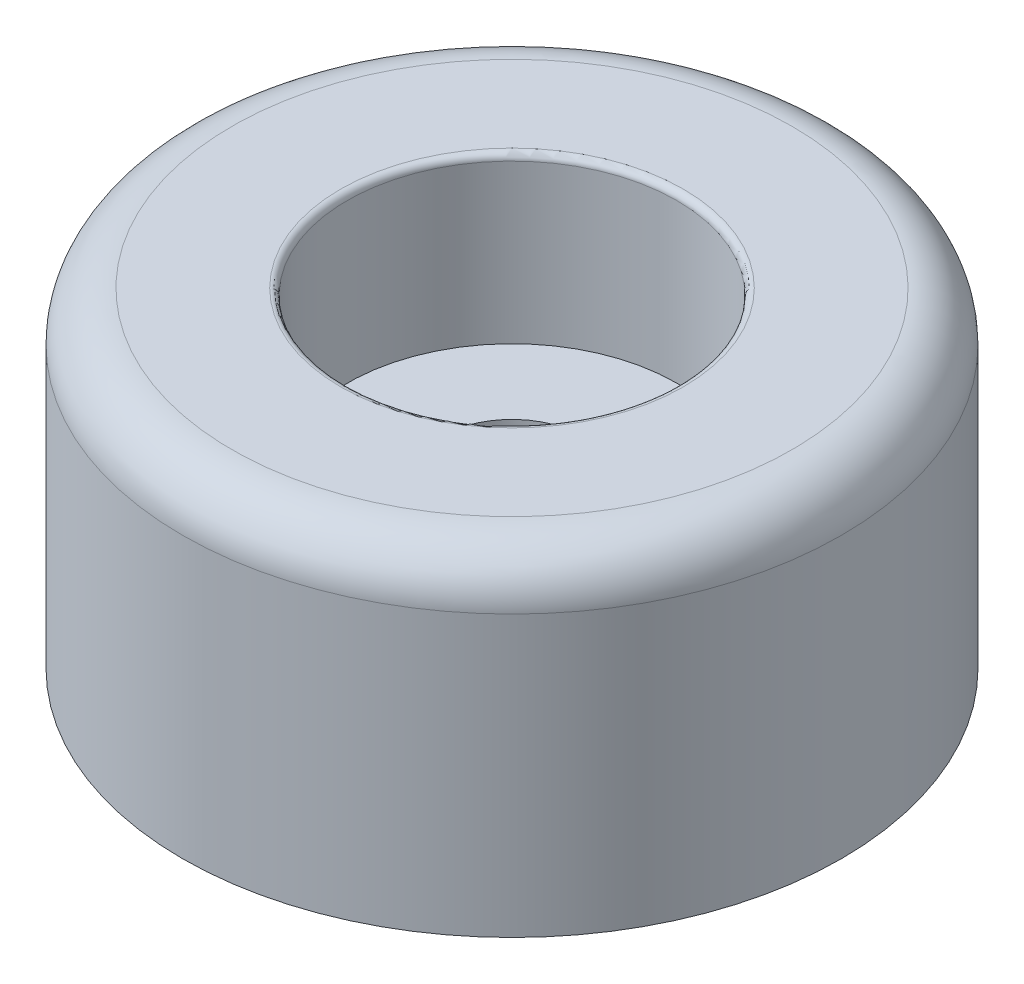
ISO-10303-21;
HEADER;
FILE_DESCRIPTION(('STEP AP214'),'2;1');
FILE_NAME('part.step','',(''),(''),'','','');
FILE_SCHEMA(('AUTOMOTIVE_DESIGN { 1 0 10303 214 1 1 1 1 }'));
ENDSEC;
DATA;
#1=APPLICATION_CONTEXT('core data for automotive mechanical design processes');
#2=APPLICATION_PROTOCOL_DEFINITION('international standard','automotive_design',2000,#1);
#3=PRODUCT_CONTEXT('',#1,'mechanical');
#4=PRODUCT('Part','Part','',(#3));
#5=PRODUCT_RELATED_PRODUCT_CATEGORY('part','',(#4));
#6=PRODUCT_DEFINITION_FORMATION('','',#4);
#7=PRODUCT_DEFINITION_CONTEXT('part definition',#1,'design');
#8=PRODUCT_DEFINITION('design','',#6,#7);
#9=PRODUCT_DEFINITION_SHAPE('','',#8);
#10=(LENGTH_UNIT() NAMED_UNIT(*) SI_UNIT(.MILLI.,.METRE.));
#11=(NAMED_UNIT(*) PLANE_ANGLE_UNIT() SI_UNIT($,.RADIAN.));
#12=(NAMED_UNIT(*) SI_UNIT($,.STERADIAN.) SOLID_ANGLE_UNIT());
#13=UNCERTAINTY_MEASURE_WITH_UNIT(LENGTH_MEASURE(1.E-05),#10,'distance_accuracy_value','');
#14=(GEOMETRIC_REPRESENTATION_CONTEXT(3) GLOBAL_UNCERTAINTY_ASSIGNED_CONTEXT((#13)) GLOBAL_UNIT_ASSIGNED_CONTEXT((#10,
#11,#12)) REPRESENTATION_CONTEXT('',''));
#15=CARTESIAN_POINT('',(0.,0.,0.));
#16=DIRECTION('',(0.,0.,1.));
#17=DIRECTION('',(1.,0.,0.));
#18=AXIS2_PLACEMENT_3D('',#15,#16,#17);
#19=CARTESIAN_POINT('',(-2.778125,0.,0.));
#20=DIRECTION('',(0.,1.,0.));
#21=DIRECTION('',(0.,0.,1.));
#22=AXIS2_PLACEMENT_3D('',#19,#20,#21);
#23=PLANE('',#22);
#24=CARTESIAN_POINT('',(0.,0.,0.));
#25=DIRECTION('',(0.,-1.,0.));
#26=DIRECTION('',(0.,0.,-1.));
#27=AXIS2_PLACEMENT_3D('',#24,#25,#26);
#28=CIRCLE('',#27,2.778125);
#29=CARTESIAN_POINT('',(0.,0.,-2.778125));
#30=VERTEX_POINT('',#29);
#31=EDGE_CURVE('E44',#30,#30,#28,.T.);
#32=ORIENTED_EDGE('',*,*,#31,.F.);
#33=EDGE_LOOP('',(#32));
#34=FACE_BOUND('',#33,.T.);
#35=CARTESIAN_POINT('',(0.,0.,0.));
#36=DIRECTION('',(0.,-1.,0.));
#37=DIRECTION('',(0.,0.,-1.));
#38=AXIS2_PLACEMENT_3D('',#35,#36,#37);
#39=CIRCLE('',#38,12.7);
#40=CARTESIAN_POINT('',(0.,0.,-12.7));
#41=VERTEX_POINT('',#40);
#42=EDGE_CURVE('E62',#41,#41,#39,.T.);
#43=ORIENTED_EDGE('',*,*,#42,.T.);
#44=EDGE_LOOP('',(#43));
#45=FACE_BOUND('',#44,.T.);
#46=ADVANCED_FACE('F33',(#34,#45),#23,.F.);
#47=CARTESIAN_POINT('',(0.,0.,0.));
#48=DIRECTION('',(0.,-1.,0.));
#49=DIRECTION('',(0.,0.,-1.));
#50=AXIS2_PLACEMENT_3D('',#47,#48,#49);
#51=CYLINDRICAL_SURFACE('',#50,2.778125);
#52=CARTESIAN_POINT('',(0.,6.34999999999999,0.));
#53=DIRECTION('',(0.,-1.,0.));
#54=DIRECTION('',(0.,0.,-1.));
#55=AXIS2_PLACEMENT_3D('',#52,#53,#54);
#56=CIRCLE('',#55,2.778125);
#57=CARTESIAN_POINT('',(0.,6.34999999999999,-2.778125));
#58=VERTEX_POINT('',#57);
#59=EDGE_CURVE('E48',#58,#58,#56,.T.);
#60=ORIENTED_EDGE('',*,*,#59,.F.);
#61=EDGE_LOOP('',(#60));
#62=FACE_BOUND('',#61,.T.);
#63=ORIENTED_EDGE('',*,*,#31,.T.);
#64=EDGE_LOOP('',(#63));
#65=FACE_BOUND('',#64,.T.);
#66=ADVANCED_FACE('F89',(#62,#65),#51,.F.);
#67=CARTESIAN_POINT('',(-6.35,6.34999999999999,0.));
#68=DIRECTION('',(0.,-1.,0.));
#69=DIRECTION('',(0.,0.,-1.));
#70=AXIS2_PLACEMENT_3D('',#67,#68,#69);
#71=PLANE('',#70);
#72=CARTESIAN_POINT('',(0.,6.34999999999999,0.));
#73=DIRECTION('',(0.,-1.,0.));
#74=DIRECTION('',(0.,0.,-1.));
#75=AXIS2_PLACEMENT_3D('',#72,#73,#74);
#76=CIRCLE('',#75,6.35);
#77=CARTESIAN_POINT('',(0.,6.34999999999999,-6.35));
#78=VERTEX_POINT('',#77);
#79=EDGE_CURVE('E53',#78,#78,#76,.T.);
#80=ORIENTED_EDGE('',*,*,#79,.F.);
#81=EDGE_LOOP('',(#80));
#82=FACE_BOUND('',#81,.T.);
#83=ORIENTED_EDGE('',*,*,#59,.T.);
#84=EDGE_LOOP('',(#83));
#85=FACE_BOUND('',#84,.T.);
#86=ADVANCED_FACE('F86',(#82,#85),#71,.F.);
#87=CARTESIAN_POINT('',(0.,0.,0.));
#88=DIRECTION('',(0.,-1.,0.));
#89=DIRECTION('',(0.,0.,-1.));
#90=AXIS2_PLACEMENT_3D('',#87,#88,#89);
#91=CYLINDRICAL_SURFACE('',#90,6.35);
#92=CARTESIAN_POINT('',(0.,12.446,0.));
#93=DIRECTION('',(0.,-1.,0.));
#94=DIRECTION('',(0.,0.,-1.));
#95=AXIS2_PLACEMENT_3D('',#92,#93,#94);
#96=CIRCLE('',#95,6.35);
#97=CARTESIAN_POINT('',(0.,12.446,-6.35));
#98=VERTEX_POINT('',#97);
#99=EDGE_CURVE('E10',#98,#98,#96,.F.);
#100=ORIENTED_EDGE('',*,*,#99,.T.);
#101=EDGE_LOOP('',(#100));
#102=FACE_BOUND('',#101,.T.);
#103=ORIENTED_EDGE('',*,*,#79,.T.);
#104=EDGE_LOOP('',(#103));
#105=FACE_BOUND('',#104,.T.);
#106=ADVANCED_FACE('F81',(#102,#105),#91,.F.);
#107=CARTESIAN_POINT('',(-10.795,12.7,0.));
#108=DIRECTION('',(0.,-1.,0.));
#109=DIRECTION('',(0.,0.,-1.));
#110=AXIS2_PLACEMENT_3D('',#107,#108,#109);
#111=PLANE('',#110);
#112=CARTESIAN_POINT('',(0.,12.7,0.));
#113=DIRECTION('',(0.,-1.,0.));
#114=DIRECTION('',(0.,0.,-1.));
#115=AXIS2_PLACEMENT_3D('',#112,#113,#114);
#116=CIRCLE('',#115,6.604);
#117=CARTESIAN_POINT('',(0.,12.7,-6.604));
#118=VERTEX_POINT('',#117);
#119=EDGE_CURVE('E40',#118,#118,#116,.T.);
#120=ORIENTED_EDGE('',*,*,#119,.T.);
#121=EDGE_LOOP('',(#120));
#122=FACE_BOUND('',#121,.T.);
#123=CARTESIAN_POINT('',(0.,12.7,0.));
#124=DIRECTION('',(0.,-1.,0.));
#125=DIRECTION('',(0.,0.,-1.));
#126=AXIS2_PLACEMENT_3D('',#123,#124,#125);
#127=CIRCLE('',#126,10.795);
#128=CARTESIAN_POINT('',(0.,12.7,-10.795));
#129=VERTEX_POINT('',#128);
#130=EDGE_CURVE('E56',#129,#129,#127,.T.);
#131=ORIENTED_EDGE('',*,*,#130,.F.);
#132=EDGE_LOOP('',(#131));
#133=FACE_BOUND('',#132,.T.);
#134=ADVANCED_FACE('F76',(#122,#133),#111,.F.);
#135=CARTESIAN_POINT('',(0.,10.795,0.));
#136=DIRECTION('',(0.,-1.,0.));
#137=DIRECTION('',(0.,0.,-1.));
#138=AXIS2_PLACEMENT_3D('',#135,#136,#137);
#139=TOROIDAL_SURFACE('',#138,10.795,1.905);
#140=CARTESIAN_POINT('',(0.,10.795,0.));
#141=DIRECTION('',(0.,-1.,0.));
#142=DIRECTION('',(0.,0.,-1.));
#143=AXIS2_PLACEMENT_3D('',#140,#141,#142);
#144=CIRCLE('',#143,12.7);
#145=CARTESIAN_POINT('',(0.,10.795,-12.7));
#146=VERTEX_POINT('',#145);
#147=EDGE_CURVE('E59',#146,#146,#144,.T.);
#148=ORIENTED_EDGE('',*,*,#147,.F.);
#149=EDGE_LOOP('',(#148));
#150=FACE_BOUND('',#149,.T.);
#151=ORIENTED_EDGE('',*,*,#130,.T.);
#152=EDGE_LOOP('',(#151));
#153=FACE_BOUND('',#152,.T.);
#154=ADVANCED_FACE('F70',(#150,#153),#139,.T.);
#155=CARTESIAN_POINT('',(0.,0.,0.));
#156=DIRECTION('',(0.,-1.,0.));
#157=DIRECTION('',(0.,0.,-1.));
#158=AXIS2_PLACEMENT_3D('',#155,#156,#157);
#159=CYLINDRICAL_SURFACE('',#158,12.7);
#160=ORIENTED_EDGE('',*,*,#42,.F.);
#161=EDGE_LOOP('',(#160));
#162=FACE_BOUND('',#161,.T.);
#163=ORIENTED_EDGE('',*,*,#147,.T.);
#164=EDGE_LOOP('',(#163));
#165=FACE_BOUND('',#164,.T.);
#166=ADVANCED_FACE('F67',(#162,#165),#159,.T.);
#167=CARTESIAN_POINT('',(0.,12.446,0.));
#168=DIRECTION('',(0.,-1.,0.));
#169=DIRECTION('',(0.,0.,-1.));
#170=AXIS2_PLACEMENT_3D('',#167,#168,#169);
#171=TOROIDAL_SURFACE('',#170,6.604,0.254);
#172=ORIENTED_EDGE('',*,*,#99,.F.);
#173=EDGE_LOOP('',(#172));
#174=FACE_BOUND('',#173,.T.);
#175=ORIENTED_EDGE('',*,*,#119,.F.);
#176=EDGE_LOOP('',(#175));
#177=FACE_BOUND('',#176,.T.);
#178=ADVANCED_FACE('F35',(#174,#177),#171,.T.);
#179=CLOSED_SHELL('',(#46,#66,#86,#106,#134,#154,#166,#178));
#180=MANIFOLD_SOLID_BREP('B2',#179);
#181=ADVANCED_BREP_SHAPE_REPRESENTATION('',(#18,#180),#14);
#182=SHAPE_DEFINITION_REPRESENTATION(#9,#181);
ENDSEC;
END-ISO-10303-21;
